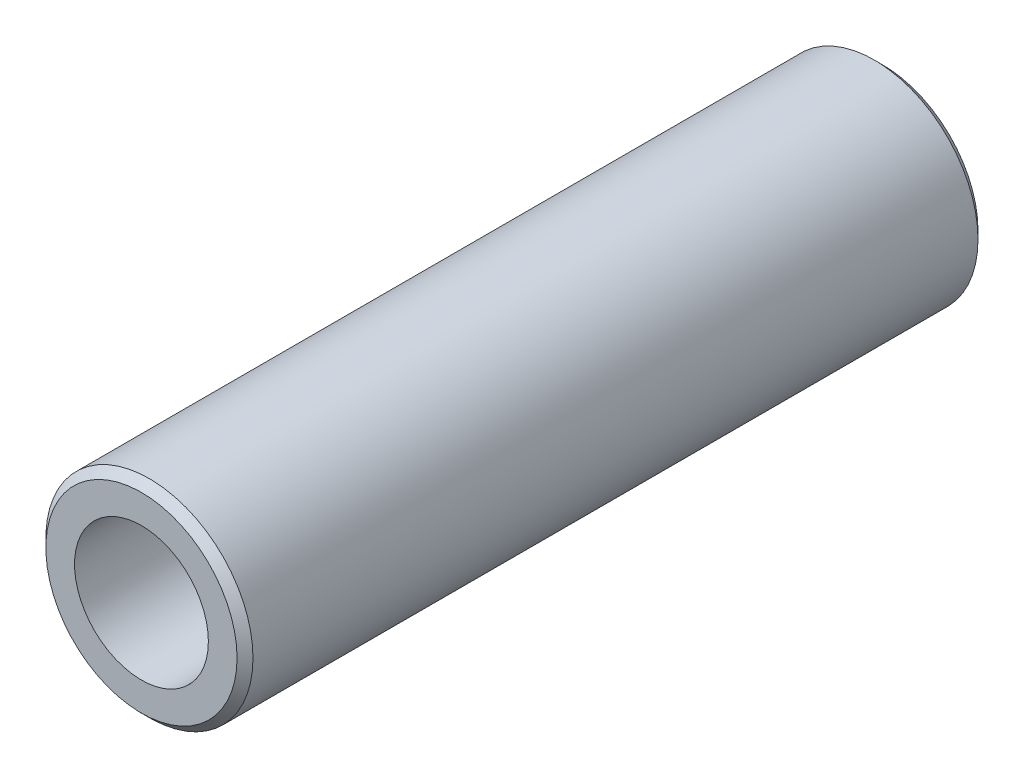
ISO-10303-21;
HEADER;
FILE_DESCRIPTION(('STEP AP214'),'2;1');
FILE_NAME('part.step','',(''),(''),'','','');
FILE_SCHEMA(('AUTOMOTIVE_DESIGN { 1 0 10303 214 1 1 1 1 }'));
ENDSEC;
DATA;
#1=APPLICATION_CONTEXT('core data for automotive mechanical design processes');
#2=APPLICATION_PROTOCOL_DEFINITION('international standard','automotive_design',2000,#1);
#3=PRODUCT_CONTEXT('',#1,'mechanical');
#4=PRODUCT('Part','Part','',(#3));
#5=PRODUCT_RELATED_PRODUCT_CATEGORY('part','',(#4));
#6=PRODUCT_DEFINITION_FORMATION('','',#4);
#7=PRODUCT_DEFINITION_CONTEXT('part definition',#1,'design');
#8=PRODUCT_DEFINITION('design','',#6,#7);
#9=PRODUCT_DEFINITION_SHAPE('','',#8);
#10=(LENGTH_UNIT() NAMED_UNIT(*) SI_UNIT(.MILLI.,.METRE.));
#11=(NAMED_UNIT(*) PLANE_ANGLE_UNIT() SI_UNIT($,.RADIAN.));
#12=(NAMED_UNIT(*) SI_UNIT($,.STERADIAN.) SOLID_ANGLE_UNIT());
#13=UNCERTAINTY_MEASURE_WITH_UNIT(LENGTH_MEASURE(1.E-05),#10,'distance_accuracy_value','');
#14=(GEOMETRIC_REPRESENTATION_CONTEXT(3) GLOBAL_UNCERTAINTY_ASSIGNED_CONTEXT((#13)) GLOBAL_UNIT_ASSIGNED_CONTEXT((#10,
#11,#12)) REPRESENTATION_CONTEXT('',''));
#15=CARTESIAN_POINT('',(0.,0.,0.));
#16=DIRECTION('',(0.,0.,1.));
#17=DIRECTION('',(1.,0.,0.));
#18=AXIS2_PLACEMENT_3D('',#15,#16,#17);
#19=CARTESIAN_POINT('',(0.,0.,46.5));
#20=DIRECTION('',(0.,0.,1.));
#21=DIRECTION('',(1.,0.,0.));
#22=AXIS2_PLACEMENT_3D('',#19,#20,#21);
#23=PLANE('',#22);
#24=CARTESIAN_POINT('',(0.,0.,46.5));
#25=DIRECTION('',(0.,0.,1.));
#26=DIRECTION('',(1.,0.,0.));
#27=AXIS2_PLACEMENT_3D('',#24,#25,#26);
#28=CIRCLE('',#27,6.00000000000004);
#29=CARTESIAN_POINT('',(6.00000000000004,0.,46.5));
#30=VERTEX_POINT('',#29);
#31=EDGE_CURVE('E48',#30,#30,#28,.T.);
#32=ORIENTED_EDGE('',*,*,#31,.T.);
#33=EDGE_LOOP('',(#32));
#34=FACE_BOUND('',#33,.T.);
#35=CARTESIAN_POINT('',(0.,0.,46.5));
#36=DIRECTION('',(0.,0.,1.));
#37=DIRECTION('',(1.,0.,0.));
#38=AXIS2_PLACEMENT_3D('',#35,#36,#37);
#39=CIRCLE('',#38,4.2);
#40=CARTESIAN_POINT('',(4.2,0.,46.5));
#41=VERTEX_POINT('',#40);
#42=EDGE_CURVE('E53',#41,#41,#39,.T.);
#43=ORIENTED_EDGE('',*,*,#42,.F.);
#44=EDGE_LOOP('',(#43));
#45=FACE_BOUND('',#44,.T.);
#46=ADVANCED_FACE('F33',(#34,#45),#23,.T.);
#47=CARTESIAN_POINT('',(0.,0.,0.));
#48=DIRECTION('',(0.,0.,1.));
#49=DIRECTION('',(1.,0.,0.));
#50=AXIS2_PLACEMENT_3D('',#47,#48,#49);
#51=PLANE('',#50);
#52=CARTESIAN_POINT('',(0.,0.,0.));
#53=DIRECTION('',(0.,0.,1.));
#54=DIRECTION('',(1.,0.,0.));
#55=AXIS2_PLACEMENT_3D('',#52,#53,#54);
#56=CIRCLE('',#55,5.99999999999996);
#57=CARTESIAN_POINT('',(5.99999999999996,0.,0.));
#58=VERTEX_POINT('',#57);
#59=EDGE_CURVE('E10',#58,#58,#56,.F.);
#60=ORIENTED_EDGE('',*,*,#59,.T.);
#61=EDGE_LOOP('',(#60));
#62=FACE_BOUND('',#61,.T.);
#63=CARTESIAN_POINT('',(0.,0.,0.));
#64=DIRECTION('',(0.,0.,1.));
#65=DIRECTION('',(1.,0.,0.));
#66=AXIS2_PLACEMENT_3D('',#63,#64,#65);
#67=CIRCLE('',#66,4.2);
#68=CARTESIAN_POINT('',(4.2,0.,0.));
#69=VERTEX_POINT('',#68);
#70=EDGE_CURVE('E54',#69,#69,#67,.T.);
#71=ORIENTED_EDGE('',*,*,#70,.T.);
#72=EDGE_LOOP('',(#71));
#73=FACE_BOUND('',#72,.T.);
#74=ADVANCED_FACE('F64',(#62,#73),#51,.F.);
#75=CARTESIAN_POINT('',(0.,0.,46.5));
#76=DIRECTION('',(0.,0.,-1.));
#77=DIRECTION('',(-1.,0.,0.));
#78=AXIS2_PLACEMENT_3D('',#75,#76,#77);
#79=CYLINDRICAL_SURFACE('',#78,6.5);
#80=CARTESIAN_POINT('',(0.,0.,46.));
#81=DIRECTION('',(0.,0.,1.));
#82=DIRECTION('',(1.,0.,0.));
#83=AXIS2_PLACEMENT_3D('',#80,#81,#82);
#84=CIRCLE('',#83,6.5);
#85=CARTESIAN_POINT('',(6.5,0.,46.));
#86=VERTEX_POINT('',#85);
#87=EDGE_CURVE('E40',#86,#86,#84,.F.);
#88=ORIENTED_EDGE('',*,*,#87,.T.);
#89=EDGE_LOOP('',(#88));
#90=FACE_BOUND('',#89,.T.);
#91=CARTESIAN_POINT('',(0.,0.,0.500000000000035));
#92=DIRECTION('',(0.,0.,1.));
#93=DIRECTION('',(1.,0.,0.));
#94=AXIS2_PLACEMENT_3D('',#91,#92,#93);
#95=CIRCLE('',#94,6.5);
#96=CARTESIAN_POINT('',(6.5,0.,0.500000000000035));
#97=VERTEX_POINT('',#96);
#98=EDGE_CURVE('E44',#97,#97,#95,.T.);
#99=ORIENTED_EDGE('',*,*,#98,.T.);
#100=EDGE_LOOP('',(#99));
#101=FACE_BOUND('',#100,.T.);
#102=ADVANCED_FACE('F70',(#90,#101),#79,.T.);
#103=CARTESIAN_POINT('',(0.,0.,46.5));
#104=DIRECTION('',(0.,0.,-1.));
#105=DIRECTION('',(-1.,0.,0.));
#106=AXIS2_PLACEMENT_3D('',#103,#104,#105);
#107=CYLINDRICAL_SURFACE('',#106,4.2);
#108=ORIENTED_EDGE('',*,*,#42,.T.);
#109=EDGE_LOOP('',(#108));
#110=FACE_BOUND('',#109,.T.);
#111=ORIENTED_EDGE('',*,*,#70,.F.);
#112=EDGE_LOOP('',(#111));
#113=FACE_BOUND('',#112,.T.);
#114=ADVANCED_FACE('F60',(#110,#113),#107,.F.);
#115=CARTESIAN_POINT('',(0.,0.,46.5));
#116=DIRECTION('',(0.,0.,-1.));
#117=DIRECTION('',(-1.,0.,0.));
#118=AXIS2_PLACEMENT_3D('',#115,#116,#117);
#119=CONICAL_SURFACE('',#118,6.00000000000004,0.785398163397444);
#120=ORIENTED_EDGE('',*,*,#87,.F.);
#121=EDGE_LOOP('',(#120));
#122=FACE_BOUND('',#121,.T.);
#123=ORIENTED_EDGE('',*,*,#31,.F.);
#124=EDGE_LOOP('',(#123));
#125=FACE_BOUND('',#124,.T.);
#126=ADVANCED_FACE('F75',(#122,#125),#119,.T.);
#127=CARTESIAN_POINT('',(0.,0.,0.500000000000035));
#128=DIRECTION('',(0.,0.,1.));
#129=DIRECTION('',(1.,0.,0.));
#130=AXIS2_PLACEMENT_3D('',#127,#128,#129);
#131=CONICAL_SURFACE('',#130,6.5,0.785398163397455);
#132=ORIENTED_EDGE('',*,*,#59,.F.);
#133=EDGE_LOOP('',(#132));
#134=FACE_BOUND('',#133,.T.);
#135=ORIENTED_EDGE('',*,*,#98,.F.);
#136=EDGE_LOOP('',(#135));
#137=FACE_BOUND('',#136,.T.);
#138=ADVANCED_FACE('F35',(#134,#137),#131,.T.);
#139=CLOSED_SHELL('',(#46,#74,#102,#114,#126,#138));
#140=MANIFOLD_SOLID_BREP('B2',#139);
#141=ADVANCED_BREP_SHAPE_REPRESENTATION('',(#18,#140),#14);
#142=SHAPE_DEFINITION_REPRESENTATION(#9,#141);
ENDSEC;
END-ISO-10303-21;
